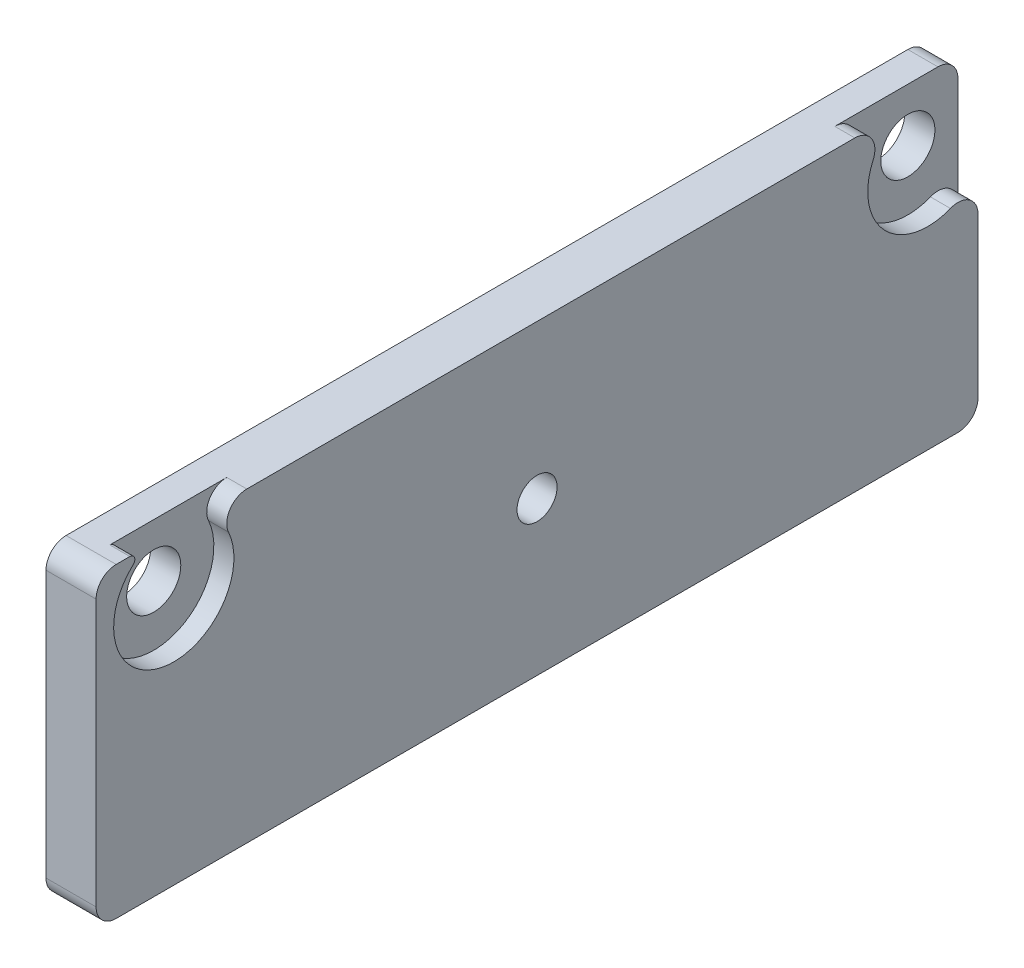
ISO-10303-21;
HEADER;
FILE_DESCRIPTION(('STEP AP214'),'2;1');
FILE_NAME('part.step','',(''),(''),'','','');
FILE_SCHEMA(('AUTOMOTIVE_DESIGN { 1 0 10303 214 1 1 1 1 }'));
ENDSEC;
DATA;
#1=APPLICATION_CONTEXT('core data for automotive mechanical design processes');
#2=APPLICATION_PROTOCOL_DEFINITION('international standard','automotive_design',2000,#1);
#3=PRODUCT_CONTEXT('',#1,'mechanical');
#4=PRODUCT('Part','Part','',(#3));
#5=PRODUCT_RELATED_PRODUCT_CATEGORY('part','',(#4));
#6=PRODUCT_DEFINITION_FORMATION('','',#4);
#7=PRODUCT_DEFINITION_CONTEXT('part definition',#1,'design');
#8=PRODUCT_DEFINITION('design','',#6,#7);
#9=PRODUCT_DEFINITION_SHAPE('','',#8);
#10=(LENGTH_UNIT() NAMED_UNIT(*) SI_UNIT(.MILLI.,.METRE.));
#11=(NAMED_UNIT(*) PLANE_ANGLE_UNIT() SI_UNIT($,.RADIAN.));
#12=(NAMED_UNIT(*) SI_UNIT($,.STERADIAN.) SOLID_ANGLE_UNIT());
#13=UNCERTAINTY_MEASURE_WITH_UNIT(LENGTH_MEASURE(1.E-05),#10,'distance_accuracy_value','');
#14=(GEOMETRIC_REPRESENTATION_CONTEXT(3) GLOBAL_UNCERTAINTY_ASSIGNED_CONTEXT((#13)) GLOBAL_UNIT_ASSIGNED_CONTEXT((#10,
#11,#12)) REPRESENTATION_CONTEXT('',''));
#15=CARTESIAN_POINT('',(0.,0.,0.));
#16=DIRECTION('',(0.,0.,1.));
#17=DIRECTION('',(1.,0.,0.));
#18=AXIS2_PLACEMENT_3D('',#15,#16,#17);
#19=CARTESIAN_POINT('',(2.5,0.,0.));
#20=DIRECTION('',(-1.,0.,0.));
#21=DIRECTION('',(0.,0.,1.));
#22=AXIS2_PLACEMENT_3D('',#19,#20,#21);
#23=PLANE('',#22);
#24=CARTESIAN_POINT('',(2.5,0.,0.));
#25=DIRECTION('',(1.,0.,0.));
#26=DIRECTION('',(0.,0.,-1.));
#27=AXIS2_PLACEMENT_3D('',#24,#25,#26);
#28=CIRCLE('',#27,1.);
#29=CARTESIAN_POINT('',(2.5,0.,-1.));
#30=VERTEX_POINT('',#29);
#31=EDGE_CURVE('E332',#30,#30,#28,.T.);
#32=ORIENTED_EDGE('',*,*,#31,.F.);
#33=EDGE_LOOP('',(#32));
#34=FACE_BOUND('',#33,.T.);
#35=CARTESIAN_POINT('',(2.5,5.,18.125));
#36=DIRECTION('',(1.,0.,0.));
#37=DIRECTION('',(0.,0.,-1.));
#38=AXIS2_PLACEMENT_3D('',#35,#36,#37);
#39=CIRCLE('',#38,3.);
#40=CARTESIAN_POINT('',(2.5,7.21538461538461,20.1478868000749));
#41=VERTEX_POINT('',#40);
#42=CARTESIAN_POINT('',(2.5,6.2375,15.3921271983497));
#43=VERTEX_POINT('',#42);
#44=EDGE_CURVE('E244',#41,#43,#39,.T.);
#45=ORIENTED_EDGE('',*,*,#44,.F.);
#46=CARTESIAN_POINT('',(2.5,7.4,20.3164607000811));
#47=DIRECTION('',(-1.,0.,0.));
#48=DIRECTION('',(0.,0.,1.));
#49=AXIS2_PLACEMENT_3D('',#46,#47,#48);
#50=CIRCLE('',#49,0.25);
#51=CARTESIAN_POINT('',(2.5,7.65,20.3164607000811));
#52=VERTEX_POINT('',#51);
#53=EDGE_CURVE('E47',#41,#52,#50,.F.);
#54=ORIENTED_EDGE('',*,*,#53,.T.);
#55=DIRECTION('',(0.,0.,1.));
#56=VECTOR('',#55,1.);
#57=CARTESIAN_POINT('',(2.5,7.65,22.));
#58=LINE('',#57,#56);
#59=CARTESIAN_POINT('',(2.5,7.65,21.));
#60=VERTEX_POINT('',#59);
#61=EDGE_CURVE('E243',#52,#60,#58,.T.);
#62=ORIENTED_EDGE('',*,*,#61,.T.);
#63=CARTESIAN_POINT('',(2.5,6.65,21.));
#64=DIRECTION('',(-1.,0.,0.));
#65=DIRECTION('',(0.,0.,1.));
#66=AXIS2_PLACEMENT_3D('',#63,#64,#65);
#67=CIRCLE('',#66,1.);
#68=CARTESIAN_POINT('',(2.5,6.65,22.));
#69=VERTEX_POINT('',#68);
#70=EDGE_CURVE('E198',#60,#69,#67,.F.);
#71=ORIENTED_EDGE('',*,*,#70,.T.);
#72=DIRECTION('',(0.,-1.,0.));
#73=VECTOR('',#72,1.);
#74=CARTESIAN_POINT('',(2.5,-7.65,22.));
#75=LINE('',#74,#73);
#76=CARTESIAN_POINT('',(2.5,-6.65,22.));
#77=VERTEX_POINT('',#76);
#78=EDGE_CURVE('E320',#69,#77,#75,.T.);
#79=ORIENTED_EDGE('',*,*,#78,.T.);
#80=CARTESIAN_POINT('',(2.5,-6.65,21.));
#81=DIRECTION('',(-1.,0.,0.));
#82=DIRECTION('',(0.,0.,1.));
#83=AXIS2_PLACEMENT_3D('',#80,#81,#82);
#84=CIRCLE('',#83,1.);
#85=CARTESIAN_POINT('',(2.5,-7.65,21.));
#86=VERTEX_POINT('',#85);
#87=EDGE_CURVE('E194',#77,#86,#84,.F.);
#88=ORIENTED_EDGE('',*,*,#87,.T.);
#89=DIRECTION('',(0.,0.,-1.));
#90=VECTOR('',#89,1.);
#91=CARTESIAN_POINT('',(2.5,-7.65,22.));
#92=LINE('',#91,#90);
#93=CARTESIAN_POINT('',(2.5,-7.65,-21.));
#94=VERTEX_POINT('',#93);
#95=EDGE_CURVE('E317',#86,#94,#92,.T.);
#96=ORIENTED_EDGE('',*,*,#95,.T.);
#97=CARTESIAN_POINT('',(2.5,-6.65,-21.));
#98=DIRECTION('',(-1.,0.,0.));
#99=DIRECTION('',(0.,0.,1.));
#100=AXIS2_PLACEMENT_3D('',#97,#98,#99);
#101=CIRCLE('',#100,1.);
#102=CARTESIAN_POINT('',(2.5,-6.65,-22.));
#103=VERTEX_POINT('',#102);
#104=EDGE_CURVE('E196',#94,#103,#101,.F.);
#105=ORIENTED_EDGE('',*,*,#104,.T.);
#106=DIRECTION('',(0.,1.,0.));
#107=VECTOR('',#106,1.);
#108=CARTESIAN_POINT('',(2.5,-7.65,-22.));
#109=LINE('',#108,#107);
#110=CARTESIAN_POINT('',(2.5,1.29190075645217,-22.));
#111=VERTEX_POINT('',#110);
#112=EDGE_CURVE('E250',#103,#111,#109,.T.);
#113=ORIENTED_EDGE('',*,*,#112,.T.);
#114=CARTESIAN_POINT('',(2.5,1.29190075645217,-21.));
#115=DIRECTION('',(-1.,0.,0.));
#116=DIRECTION('',(0.,0.,1.));
#117=AXIS2_PLACEMENT_3D('',#114,#115,#116);
#118=CIRCLE('',#117,1.);
#119=CARTESIAN_POINT('',(2.5,2.21892556733913,-20.625));
#120=VERTEX_POINT('',#119);
#121=EDGE_CURVE('E192',#111,#120,#118,.F.);
#122=ORIENTED_EDGE('',*,*,#121,.T.);
#123=CARTESIAN_POINT('',(2.5,5.,-19.5));
#124=DIRECTION('',(1.,0.,0.));
#125=DIRECTION('',(0.,0.,-1.));
#126=AXIS2_PLACEMENT_3D('',#123,#124,#125);
#127=CIRCLE('',#126,3.);
#128=CARTESIAN_POINT('',(2.5,6.2375,-16.7671271983497));
#129=VERTEX_POINT('',#128);
#130=EDGE_CURVE('E356',#129,#120,#127,.T.);
#131=ORIENTED_EDGE('',*,*,#130,.F.);
#132=CARTESIAN_POINT('',(2.5,6.65,-15.8561695977996));
#133=DIRECTION('',(-1.,0.,0.));
#134=DIRECTION('',(0.,0.,1.));
#135=AXIS2_PLACEMENT_3D('',#132,#133,#134);
#136=CIRCLE('',#135,1.);
#137=CARTESIAN_POINT('',(2.5,7.65,-15.8561695977996));
#138=VERTEX_POINT('',#137);
#139=EDGE_CURVE('E203',#129,#138,#136,.F.);
#140=ORIENTED_EDGE('',*,*,#139,.T.);
#141=CARTESIAN_POINT('',(2.5,7.65,14.4811695977996));
#142=VERTEX_POINT('',#141);
#143=EDGE_CURVE('E249',#138,#142,#58,.T.);
#144=ORIENTED_EDGE('',*,*,#143,.T.);
#145=CARTESIAN_POINT('',(2.5,6.65,14.4811695977996));
#146=DIRECTION('',(-1.,0.,0.));
#147=DIRECTION('',(0.,0.,1.));
#148=AXIS2_PLACEMENT_3D('',#145,#146,#147);
#149=CIRCLE('',#148,1.);
#150=EDGE_CURVE('E200',#142,#43,#149,.F.);
#151=ORIENTED_EDGE('',*,*,#150,.T.);
#152=EDGE_LOOP('',(#45,#54,#62,#71,#79,#88,#96,#105,#113,#122,#131,#140,#144,#151));
#153=FACE_BOUND('',#152,.T.);
#154=ADVANCED_FACE('F39',(#34,#153),#23,.F.);
#155=CARTESIAN_POINT('',(0.,0.,0.));
#156=DIRECTION('',(-1.,0.,0.));
#157=DIRECTION('',(0.,0.,1.));
#158=AXIS2_PLACEMENT_3D('',#155,#156,#157);
#159=PLANE('',#158);
#160=CARTESIAN_POINT('',(0.,0.,0.));
#161=DIRECTION('',(1.,0.,0.));
#162=DIRECTION('',(0.,0.,-1.));
#163=AXIS2_PLACEMENT_3D('',#160,#161,#162);
#164=CIRCLE('',#163,1.);
#165=CARTESIAN_POINT('',(0.,0.,-1.));
#166=VERTEX_POINT('',#165);
#167=EDGE_CURVE('E342',#166,#166,#164,.T.);
#168=ORIENTED_EDGE('',*,*,#167,.T.);
#169=EDGE_LOOP('',(#168));
#170=FACE_BOUND('',#169,.T.);
#171=DIRECTION('',(0.,-1.,0.));
#172=VECTOR('',#171,1.);
#173=CARTESIAN_POINT('',(0.,-7.65,22.));
#174=LINE('',#173,#172);
#175=CARTESIAN_POINT('',(0.,6.65,22.));
#176=VERTEX_POINT('',#175);
#177=CARTESIAN_POINT('',(0.,-6.65,22.));
#178=VERTEX_POINT('',#177);
#179=EDGE_CURVE('E334',#176,#178,#174,.T.);
#180=ORIENTED_EDGE('',*,*,#179,.F.);
#181=CARTESIAN_POINT('',(0.,6.65,21.));
#182=DIRECTION('',(-1.,0.,0.));
#183=DIRECTION('',(0.,0.,1.));
#184=AXIS2_PLACEMENT_3D('',#181,#182,#183);
#185=CIRCLE('',#184,1.);
#186=CARTESIAN_POINT('',(0.,7.65,21.));
#187=VERTEX_POINT('',#186);
#188=EDGE_CURVE('E218',#176,#187,#185,.T.);
#189=ORIENTED_EDGE('',*,*,#188,.T.);
#190=DIRECTION('',(0.,0.,1.));
#191=VECTOR('',#190,1.);
#192=CARTESIAN_POINT('',(0.,7.65,22.));
#193=LINE('',#192,#191);
#194=CARTESIAN_POINT('',(0.,7.65,-21.));
#195=VERTEX_POINT('',#194);
#196=EDGE_CURVE('E331',#195,#187,#193,.T.);
#197=ORIENTED_EDGE('',*,*,#196,.F.);
#198=CARTESIAN_POINT('',(0.,6.65,-21.));
#199=DIRECTION('',(-1.,0.,0.));
#200=DIRECTION('',(0.,0.,1.));
#201=AXIS2_PLACEMENT_3D('',#198,#199,#200);
#202=CIRCLE('',#201,1.);
#203=CARTESIAN_POINT('',(0.,6.65,-22.));
#204=VERTEX_POINT('',#203);
#205=EDGE_CURVE('E177',#195,#204,#202,.T.);
#206=ORIENTED_EDGE('',*,*,#205,.T.);
#207=DIRECTION('',(0.,1.,0.));
#208=VECTOR('',#207,1.);
#209=CARTESIAN_POINT('',(0.,-7.65,-22.));
#210=LINE('',#209,#208);
#211=CARTESIAN_POINT('',(0.,-6.65,-22.));
#212=VERTEX_POINT('',#211);
#213=EDGE_CURVE('E328',#212,#204,#210,.T.);
#214=ORIENTED_EDGE('',*,*,#213,.F.);
#215=CARTESIAN_POINT('',(0.,-6.65,-21.));
#216=DIRECTION('',(-1.,0.,0.));
#217=DIRECTION('',(0.,0.,1.));
#218=AXIS2_PLACEMENT_3D('',#215,#216,#217);
#219=CIRCLE('',#218,1.);
#220=CARTESIAN_POINT('',(0.,-7.65,-21.));
#221=VERTEX_POINT('',#220);
#222=EDGE_CURVE('E215',#212,#221,#219,.T.);
#223=ORIENTED_EDGE('',*,*,#222,.T.);
#224=DIRECTION('',(0.,0.,-1.));
#225=VECTOR('',#224,1.);
#226=CARTESIAN_POINT('',(0.,-7.65,22.));
#227=LINE('',#226,#225);
#228=CARTESIAN_POINT('',(0.,-7.65,21.));
#229=VERTEX_POINT('',#228);
#230=EDGE_CURVE('E337',#229,#221,#227,.T.);
#231=ORIENTED_EDGE('',*,*,#230,.F.);
#232=CARTESIAN_POINT('',(0.,-6.65,21.));
#233=DIRECTION('',(-1.,0.,0.));
#234=DIRECTION('',(0.,0.,1.));
#235=AXIS2_PLACEMENT_3D('',#232,#233,#234);
#236=CIRCLE('',#235,1.);
#237=EDGE_CURVE('E213',#229,#178,#236,.T.);
#238=ORIENTED_EDGE('',*,*,#237,.T.);
#239=EDGE_LOOP('',(#180,#189,#197,#206,#214,#223,#231,#238));
#240=FACE_BOUND('',#239,.T.);
#241=CARTESIAN_POINT('',(0.,5.,-19.5));
#242=DIRECTION('',(1.,0.,0.));
#243=DIRECTION('',(0.,0.,-1.));
#244=AXIS2_PLACEMENT_3D('',#241,#242,#243);
#245=CIRCLE('',#244,1.35);
#246=CARTESIAN_POINT('',(0.,5.,-20.85));
#247=VERTEX_POINT('',#246);
#248=EDGE_CURVE('E345',#247,#247,#245,.T.);
#249=ORIENTED_EDGE('',*,*,#248,.T.);
#250=EDGE_LOOP('',(#249));
#251=FACE_BOUND('',#250,.T.);
#252=CARTESIAN_POINT('',(0.,5.,18.125));
#253=DIRECTION('',(1.,0.,0.));
#254=DIRECTION('',(0.,0.,-1.));
#255=AXIS2_PLACEMENT_3D('',#252,#253,#254);
#256=CIRCLE('',#255,1.35);
#257=CARTESIAN_POINT('',(0.,5.,16.775));
#258=VERTEX_POINT('',#257);
#259=EDGE_CURVE('E359',#258,#258,#256,.T.);
#260=ORIENTED_EDGE('',*,*,#259,.T.);
#261=EDGE_LOOP('',(#260));
#262=FACE_BOUND('',#261,.T.);
#263=ADVANCED_FACE('F261',(#170,#240,#251,#262),#159,.T.);
#264=CARTESIAN_POINT('',(2.5,-7.65,-22.));
#265=DIRECTION('',(0.,0.,1.));
#266=DIRECTION('',(1.,0.,0.));
#267=AXIS2_PLACEMENT_3D('',#264,#265,#266);
#268=PLANE('',#267);
#269=ORIENTED_EDGE('',*,*,#213,.T.);
#270=DIRECTION('',(-1.,0.,0.));
#271=VECTOR('',#270,1.);
#272=CARTESIAN_POINT('',(2.5,6.65,-22.));
#273=LINE('',#272,#271);
#274=CARTESIAN_POINT('',(1.5,6.65,-22.));
#275=VERTEX_POINT('',#274);
#276=EDGE_CURVE('E161',#204,#275,#273,.F.);
#277=ORIENTED_EDGE('',*,*,#276,.T.);
#278=DIRECTION('',(0.,-1.,0.));
#279=VECTOR('',#278,1.);
#280=CARTESIAN_POINT('',(1.5,-7.65,-22.));
#281=LINE('',#280,#279);
#282=CARTESIAN_POINT('',(1.5,1.29190075645217,-22.));
#283=VERTEX_POINT('',#282);
#284=EDGE_CURVE('E156',#275,#283,#281,.T.);
#285=ORIENTED_EDGE('',*,*,#284,.T.);
#286=DIRECTION('',(1.,0.,0.));
#287=VECTOR('',#286,1.);
#288=CARTESIAN_POINT('',(2.5,1.29190075645217,-22.));
#289=LINE('',#288,#287);
#290=EDGE_CURVE('E220',#283,#111,#289,.T.);
#291=ORIENTED_EDGE('',*,*,#290,.T.);
#292=ORIENTED_EDGE('',*,*,#112,.F.);
#293=DIRECTION('',(-1.,0.,0.));
#294=VECTOR('',#293,1.);
#295=CARTESIAN_POINT('',(2.5,-6.65,-22.));
#296=LINE('',#295,#294);
#297=EDGE_CURVE('E223',#103,#212,#296,.T.);
#298=ORIENTED_EDGE('',*,*,#297,.T.);
#299=EDGE_LOOP('',(#269,#277,#285,#291,#292,#298));
#300=FACE_BOUND('',#299,.T.);
#301=ADVANCED_FACE('F268',(#300),#268,.F.);
#302=CARTESIAN_POINT('',(2.5,7.65,22.));
#303=DIRECTION('',(0.,-1.,0.));
#304=DIRECTION('',(0.,0.,-1.));
#305=AXIS2_PLACEMENT_3D('',#302,#303,#304);
#306=PLANE('',#305);
#307=ORIENTED_EDGE('',*,*,#61,.F.);
#308=DIRECTION('',(1.,0.,0.));
#309=VECTOR('',#308,1.);
#310=CARTESIAN_POINT('',(2.5,7.65,20.3164607000811));
#311=LINE('',#310,#309);
#312=CARTESIAN_POINT('',(1.5,7.65,20.3164607000811));
#313=VERTEX_POINT('',#312);
#314=EDGE_CURVE('E238',#52,#313,#311,.F.);
#315=ORIENTED_EDGE('',*,*,#314,.T.);
#316=DIRECTION('',(0.,0.,-1.));
#317=VECTOR('',#316,1.);
#318=CARTESIAN_POINT('',(1.5,7.65,22.));
#319=LINE('',#318,#317);
#320=CARTESIAN_POINT('',(1.5,7.65,14.4811695977996));
#321=VERTEX_POINT('',#320);
#322=EDGE_CURVE('E174',#313,#321,#319,.T.);
#323=ORIENTED_EDGE('',*,*,#322,.T.);
#324=DIRECTION('',(1.,0.,0.));
#325=VECTOR('',#324,1.);
#326=CARTESIAN_POINT('',(2.5,7.65,14.4811695977996));
#327=LINE('',#326,#325);
#328=EDGE_CURVE('E181',#321,#142,#327,.T.);
#329=ORIENTED_EDGE('',*,*,#328,.T.);
#330=ORIENTED_EDGE('',*,*,#143,.F.);
#331=DIRECTION('',(1.,0.,0.));
#332=VECTOR('',#331,1.);
#333=CARTESIAN_POINT('',(2.5,7.65,-15.8561695977996));
#334=LINE('',#333,#332);
#335=CARTESIAN_POINT('',(1.5,7.65,-15.8561695977996));
#336=VERTEX_POINT('',#335);
#337=EDGE_CURVE('E173',#138,#336,#334,.F.);
#338=ORIENTED_EDGE('',*,*,#337,.T.);
#339=DIRECTION('',(0.,0.,-1.));
#340=VECTOR('',#339,1.);
#341=CARTESIAN_POINT('',(1.5,7.65,22.));
#342=LINE('',#341,#340);
#343=CARTESIAN_POINT('',(1.5,7.65,-21.));
#344=VERTEX_POINT('',#343);
#345=EDGE_CURVE('E153',#336,#344,#342,.T.);
#346=ORIENTED_EDGE('',*,*,#345,.T.);
#347=DIRECTION('',(-1.,0.,0.));
#348=VECTOR('',#347,1.);
#349=CARTESIAN_POINT('',(2.5,7.65,-21.));
#350=LINE('',#349,#348);
#351=EDGE_CURVE('E169',#344,#195,#350,.T.);
#352=ORIENTED_EDGE('',*,*,#351,.T.);
#353=ORIENTED_EDGE('',*,*,#196,.T.);
#354=DIRECTION('',(-1.,0.,0.));
#355=VECTOR('',#354,1.);
#356=CARTESIAN_POINT('',(2.5,7.65,21.));
#357=LINE('',#356,#355);
#358=EDGE_CURVE('E178',#187,#60,#357,.F.);
#359=ORIENTED_EDGE('',*,*,#358,.T.);
#360=EDGE_LOOP('',(#307,#315,#323,#329,#330,#338,#346,#352,#353,#359));
#361=FACE_BOUND('',#360,.T.);
#362=ADVANCED_FACE('F167',(#361),#306,.F.);
#363=CARTESIAN_POINT('',(2.5,-7.65,22.));
#364=DIRECTION('',(0.,0.,-1.));
#365=DIRECTION('',(-1.,0.,0.));
#366=AXIS2_PLACEMENT_3D('',#363,#364,#365);
#367=PLANE('',#366);
#368=ORIENTED_EDGE('',*,*,#78,.F.);
#369=DIRECTION('',(-1.,0.,0.));
#370=VECTOR('',#369,1.);
#371=CARTESIAN_POINT('',(2.5,6.65,22.));
#372=LINE('',#371,#370);
#373=EDGE_CURVE('E210',#69,#176,#372,.T.);
#374=ORIENTED_EDGE('',*,*,#373,.T.);
#375=ORIENTED_EDGE('',*,*,#179,.T.);
#376=DIRECTION('',(-1.,0.,0.));
#377=VECTOR('',#376,1.);
#378=CARTESIAN_POINT('',(2.5,-6.65,22.));
#379=LINE('',#378,#377);
#380=EDGE_CURVE('E208',#178,#77,#379,.F.);
#381=ORIENTED_EDGE('',*,*,#380,.T.);
#382=EDGE_LOOP('',(#368,#374,#375,#381));
#383=FACE_BOUND('',#382,.T.);
#384=ADVANCED_FACE('F279',(#383),#367,.F.);
#385=CARTESIAN_POINT('',(2.5,-7.65,22.));
#386=DIRECTION('',(0.,1.,0.));
#387=DIRECTION('',(0.,0.,1.));
#388=AXIS2_PLACEMENT_3D('',#385,#386,#387);
#389=PLANE('',#388);
#390=ORIENTED_EDGE('',*,*,#230,.T.);
#391=DIRECTION('',(-1.,0.,0.));
#392=VECTOR('',#391,1.);
#393=CARTESIAN_POINT('',(2.5,-7.65,-21.));
#394=LINE('',#393,#392);
#395=EDGE_CURVE('E229',#221,#94,#394,.F.);
#396=ORIENTED_EDGE('',*,*,#395,.T.);
#397=ORIENTED_EDGE('',*,*,#95,.F.);
#398=DIRECTION('',(-1.,0.,0.));
#399=VECTOR('',#398,1.);
#400=CARTESIAN_POINT('',(2.5,-7.65,21.));
#401=LINE('',#400,#399);
#402=EDGE_CURVE('E160',#86,#229,#401,.T.);
#403=ORIENTED_EDGE('',*,*,#402,.T.);
#404=EDGE_LOOP('',(#390,#396,#397,#403));
#405=FACE_BOUND('',#404,.T.);
#406=ADVANCED_FACE('F276',(#405),#389,.F.);
#407=CARTESIAN_POINT('',(2.5,0.,0.));
#408=DIRECTION('',(-1.,0.,0.));
#409=DIRECTION('',(0.,0.,1.));
#410=AXIS2_PLACEMENT_3D('',#407,#408,#409);
#411=CYLINDRICAL_SURFACE('',#410,1.);
#412=ORIENTED_EDGE('',*,*,#31,.T.);
#413=EDGE_LOOP('',(#412));
#414=FACE_BOUND('',#413,.T.);
#415=ORIENTED_EDGE('',*,*,#167,.F.);
#416=EDGE_LOOP('',(#415));
#417=FACE_BOUND('',#416,.T.);
#418=ADVANCED_FACE('F273',(#414,#417),#411,.F.);
#419=CARTESIAN_POINT('',(1.5,6.35,-19.5));
#420=DIRECTION('',(-1.,0.,0.));
#421=DIRECTION('',(0.,0.,1.));
#422=AXIS2_PLACEMENT_3D('',#419,#420,#421);
#423=PLANE('',#422);
#424=CARTESIAN_POINT('',(1.5,5.,-19.5));
#425=DIRECTION('',(1.,0.,0.));
#426=DIRECTION('',(0.,0.,-1.));
#427=AXIS2_PLACEMENT_3D('',#424,#425,#426);
#428=CIRCLE('',#427,1.35);
#429=CARTESIAN_POINT('',(1.5,5.,-20.85));
#430=VERTEX_POINT('',#429);
#431=EDGE_CURVE('E350',#430,#430,#428,.T.);
#432=ORIENTED_EDGE('',*,*,#431,.F.);
#433=EDGE_LOOP('',(#432));
#434=FACE_BOUND('',#433,.T.);
#435=ORIENTED_EDGE('',*,*,#284,.F.);
#436=CARTESIAN_POINT('',(1.5,6.65,-21.));
#437=DIRECTION('',(-1.,0.,0.));
#438=DIRECTION('',(0.,0.,1.));
#439=AXIS2_PLACEMENT_3D('',#436,#437,#438);
#440=CIRCLE('',#439,1.);
#441=EDGE_CURVE('E150',#275,#344,#440,.F.);
#442=ORIENTED_EDGE('',*,*,#441,.T.);
#443=ORIENTED_EDGE('',*,*,#345,.F.);
#444=CARTESIAN_POINT('',(1.5,6.65,-15.8561695977996));
#445=DIRECTION('',(-1.,0.,0.));
#446=DIRECTION('',(0.,0.,1.));
#447=AXIS2_PLACEMENT_3D('',#444,#445,#446);
#448=CIRCLE('',#447,1.);
#449=CARTESIAN_POINT('',(1.5,6.2375,-16.7671271983497));
#450=VERTEX_POINT('',#449);
#451=EDGE_CURVE('E231',#336,#450,#448,.T.);
#452=ORIENTED_EDGE('',*,*,#451,.T.);
#453=CARTESIAN_POINT('',(1.5,5.,-19.5));
#454=DIRECTION('',(1.,0.,0.));
#455=DIRECTION('',(0.,0.,-1.));
#456=AXIS2_PLACEMENT_3D('',#453,#454,#455);
#457=CIRCLE('',#456,3.);
#458=CARTESIAN_POINT('',(1.5,2.21892556733913,-20.625));
#459=VERTEX_POINT('',#458);
#460=EDGE_CURVE('E353',#450,#459,#457,.T.);
#461=ORIENTED_EDGE('',*,*,#460,.T.);
#462=CARTESIAN_POINT('',(1.5,1.29190075645217,-21.));
#463=DIRECTION('',(-1.,0.,0.));
#464=DIRECTION('',(0.,0.,1.));
#465=AXIS2_PLACEMENT_3D('',#462,#463,#464);
#466=CIRCLE('',#465,1.);
#467=EDGE_CURVE('E236',#459,#283,#466,.T.);
#468=ORIENTED_EDGE('',*,*,#467,.T.);
#469=EDGE_LOOP('',(#435,#442,#443,#452,#461,#468));
#470=FACE_BOUND('',#469,.T.);
#471=ADVANCED_FACE('F152',(#434,#470),#423,.F.);
#472=CARTESIAN_POINT('',(2.5,5.,-19.5));
#473=DIRECTION('',(1.,0.,0.));
#474=DIRECTION('',(0.,0.,-1.));
#475=AXIS2_PLACEMENT_3D('',#472,#473,#474);
#476=CYLINDRICAL_SURFACE('',#475,3.);
#477=ORIENTED_EDGE('',*,*,#460,.F.);
#478=DIRECTION('',(1.,0.,0.));
#479=VECTOR('',#478,1.);
#480=CARTESIAN_POINT('',(2.5,6.2375,-16.7671271983497));
#481=LINE('',#480,#479);
#482=EDGE_CURVE('E190',#450,#129,#481,.T.);
#483=ORIENTED_EDGE('',*,*,#482,.T.);
#484=ORIENTED_EDGE('',*,*,#130,.T.);
#485=DIRECTION('',(1.,0.,0.));
#486=VECTOR('',#485,1.);
#487=CARTESIAN_POINT('',(2.5,2.21892556733913,-20.625));
#488=LINE('',#487,#486);
#489=EDGE_CURVE('E188',#120,#459,#488,.F.);
#490=ORIENTED_EDGE('',*,*,#489,.T.);
#491=EDGE_LOOP('',(#477,#483,#484,#490));
#492=FACE_BOUND('',#491,.T.);
#493=ADVANCED_FACE('F378',(#492),#476,.F.);
#494=CARTESIAN_POINT('',(2.5,5.,-19.5));
#495=DIRECTION('',(1.,0.,0.));
#496=DIRECTION('',(0.,0.,-1.));
#497=AXIS2_PLACEMENT_3D('',#494,#495,#496);
#498=CYLINDRICAL_SURFACE('',#497,1.35);
#499=ORIENTED_EDGE('',*,*,#248,.F.);
#500=EDGE_LOOP('',(#499));
#501=FACE_BOUND('',#500,.T.);
#502=ORIENTED_EDGE('',*,*,#431,.T.);
#503=EDGE_LOOP('',(#502));
#504=FACE_BOUND('',#503,.T.);
#505=ADVANCED_FACE('F398',(#501,#504),#498,.F.);
#506=CARTESIAN_POINT('',(1.5,6.35,18.125));
#507=DIRECTION('',(-1.,0.,0.));
#508=DIRECTION('',(0.,0.,1.));
#509=AXIS2_PLACEMENT_3D('',#506,#507,#508);
#510=PLANE('',#509);
#511=CARTESIAN_POINT('',(1.5,5.,18.125));
#512=DIRECTION('',(1.,0.,0.));
#513=DIRECTION('',(0.,0.,-1.));
#514=AXIS2_PLACEMENT_3D('',#511,#512,#513);
#515=CIRCLE('',#514,1.35);
#516=CARTESIAN_POINT('',(1.5,5.,16.775));
#517=VERTEX_POINT('',#516);
#518=EDGE_CURVE('E362',#517,#517,#515,.T.);
#519=ORIENTED_EDGE('',*,*,#518,.F.);
#520=EDGE_LOOP('',(#519));
#521=FACE_BOUND('',#520,.T.);
#522=ORIENTED_EDGE('',*,*,#322,.F.);
#523=CARTESIAN_POINT('',(1.5,7.4,20.3164607000811));
#524=DIRECTION('',(-1.,0.,0.));
#525=DIRECTION('',(0.,0.,1.));
#526=AXIS2_PLACEMENT_3D('',#523,#524,#525);
#527=CIRCLE('',#526,0.25);
#528=CARTESIAN_POINT('',(1.5,7.21538461538461,20.1478868000749));
#529=VERTEX_POINT('',#528);
#530=EDGE_CURVE('E11',#313,#529,#527,.T.);
#531=ORIENTED_EDGE('',*,*,#530,.T.);
#532=CARTESIAN_POINT('',(1.5,5.,18.125));
#533=DIRECTION('',(1.,0.,0.));
#534=DIRECTION('',(0.,0.,-1.));
#535=AXIS2_PLACEMENT_3D('',#532,#533,#534);
#536=CIRCLE('',#535,3.);
#537=CARTESIAN_POINT('',(1.5,6.2375,15.3921271983497));
#538=VERTEX_POINT('',#537);
#539=EDGE_CURVE('E365',#529,#538,#536,.T.);
#540=ORIENTED_EDGE('',*,*,#539,.T.);
#541=CARTESIAN_POINT('',(1.5,6.65,14.4811695977996));
#542=DIRECTION('',(-1.,0.,0.));
#543=DIRECTION('',(0.,0.,1.));
#544=AXIS2_PLACEMENT_3D('',#541,#542,#543);
#545=CIRCLE('',#544,1.);
#546=EDGE_CURVE('E233',#538,#321,#545,.T.);
#547=ORIENTED_EDGE('',*,*,#546,.T.);
#548=EDGE_LOOP('',(#522,#531,#540,#547));
#549=FACE_BOUND('',#548,.T.);
#550=ADVANCED_FACE('F372',(#521,#549),#510,.F.);
#551=CARTESIAN_POINT('',(2.5,5.,18.125));
#552=DIRECTION('',(1.,0.,0.));
#553=DIRECTION('',(0.,0.,-1.));
#554=AXIS2_PLACEMENT_3D('',#551,#552,#553);
#555=CYLINDRICAL_SURFACE('',#554,3.);
#556=ORIENTED_EDGE('',*,*,#539,.F.);
#557=DIRECTION('',(1.,0.,0.));
#558=VECTOR('',#557,1.);
#559=CARTESIAN_POINT('',(2.5,7.21538461538461,20.1478868000749));
#560=LINE('',#559,#558);
#561=EDGE_CURVE('E59',#529,#41,#560,.T.);
#562=ORIENTED_EDGE('',*,*,#561,.T.);
#563=ORIENTED_EDGE('',*,*,#44,.T.);
#564=DIRECTION('',(1.,0.,0.));
#565=VECTOR('',#564,1.);
#566=CARTESIAN_POINT('',(2.5,6.2375,15.3921271983497));
#567=LINE('',#566,#565);
#568=EDGE_CURVE('E205',#43,#538,#567,.F.);
#569=ORIENTED_EDGE('',*,*,#568,.T.);
#570=EDGE_LOOP('',(#556,#562,#563,#569));
#571=FACE_BOUND('',#570,.T.);
#572=ADVANCED_FACE('F367',(#571),#555,.F.);
#573=CARTESIAN_POINT('',(2.5,5.,18.125));
#574=DIRECTION('',(1.,0.,0.));
#575=DIRECTION('',(0.,0.,-1.));
#576=AXIS2_PLACEMENT_3D('',#573,#574,#575);
#577=CYLINDRICAL_SURFACE('',#576,1.35);
#578=ORIENTED_EDGE('',*,*,#259,.F.);
#579=EDGE_LOOP('',(#578));
#580=FACE_BOUND('',#579,.T.);
#581=ORIENTED_EDGE('',*,*,#518,.T.);
#582=EDGE_LOOP('',(#581));
#583=FACE_BOUND('',#582,.T.);
#584=ADVANCED_FACE('F292',(#580,#583),#577,.F.);
#585=CARTESIAN_POINT('',(2.5,6.65,-15.8561695977996));
#586=DIRECTION('',(1.,0.,0.));
#587=DIRECTION('',(0.,0.,-1.));
#588=AXIS2_PLACEMENT_3D('',#585,#586,#587);
#589=CYLINDRICAL_SURFACE('',#588,1.);
#590=ORIENTED_EDGE('',*,*,#139,.F.);
#591=ORIENTED_EDGE('',*,*,#482,.F.);
#592=ORIENTED_EDGE('',*,*,#451,.F.);
#593=ORIENTED_EDGE('',*,*,#337,.F.);
#594=EDGE_LOOP('',(#590,#591,#592,#593));
#595=FACE_BOUND('',#594,.T.);
#596=ADVANCED_FACE('F288',(#595),#589,.T.);
#597=CARTESIAN_POINT('',(2.5,6.65,14.4811695977996));
#598=DIRECTION('',(1.,0.,0.));
#599=DIRECTION('',(0.,0.,-1.));
#600=AXIS2_PLACEMENT_3D('',#597,#598,#599);
#601=CYLINDRICAL_SURFACE('',#600,1.);
#602=ORIENTED_EDGE('',*,*,#546,.F.);
#603=ORIENTED_EDGE('',*,*,#568,.F.);
#604=ORIENTED_EDGE('',*,*,#150,.F.);
#605=ORIENTED_EDGE('',*,*,#328,.F.);
#606=EDGE_LOOP('',(#602,#603,#604,#605));
#607=FACE_BOUND('',#606,.T.);
#608=ADVANCED_FACE('F291',(#607),#601,.T.);
#609=CARTESIAN_POINT('',(2.5,6.65,21.));
#610=DIRECTION('',(-1.,0.,0.));
#611=DIRECTION('',(0.,0.,1.));
#612=AXIS2_PLACEMENT_3D('',#609,#610,#611);
#613=CYLINDRICAL_SURFACE('',#612,1.);
#614=ORIENTED_EDGE('',*,*,#70,.F.);
#615=ORIENTED_EDGE('',*,*,#358,.F.);
#616=ORIENTED_EDGE('',*,*,#188,.F.);
#617=ORIENTED_EDGE('',*,*,#373,.F.);
#618=EDGE_LOOP('',(#614,#615,#616,#617));
#619=FACE_BOUND('',#618,.T.);
#620=ADVANCED_FACE('F296',(#619),#613,.T.);
#621=CARTESIAN_POINT('',(2.5,6.65,-21.));
#622=DIRECTION('',(-1.,0.,0.));
#623=DIRECTION('',(0.,0.,1.));
#624=AXIS2_PLACEMENT_3D('',#621,#622,#623);
#625=CYLINDRICAL_SURFACE('',#624,1.);
#626=ORIENTED_EDGE('',*,*,#441,.F.);
#627=ORIENTED_EDGE('',*,*,#276,.F.);
#628=ORIENTED_EDGE('',*,*,#205,.F.);
#629=ORIENTED_EDGE('',*,*,#351,.F.);
#630=EDGE_LOOP('',(#626,#627,#628,#629));
#631=FACE_BOUND('',#630,.T.);
#632=ADVANCED_FACE('F176',(#631),#625,.T.);
#633=CARTESIAN_POINT('',(2.5,-6.65,-21.));
#634=DIRECTION('',(-1.,0.,0.));
#635=DIRECTION('',(0.,0.,1.));
#636=AXIS2_PLACEMENT_3D('',#633,#634,#635);
#637=CYLINDRICAL_SURFACE('',#636,1.);
#638=ORIENTED_EDGE('',*,*,#104,.F.);
#639=ORIENTED_EDGE('',*,*,#395,.F.);
#640=ORIENTED_EDGE('',*,*,#222,.F.);
#641=ORIENTED_EDGE('',*,*,#297,.F.);
#642=EDGE_LOOP('',(#638,#639,#640,#641));
#643=FACE_BOUND('',#642,.T.);
#644=ADVANCED_FACE('F303',(#643),#637,.T.);
#645=CARTESIAN_POINT('',(2.5,-6.65,21.));
#646=DIRECTION('',(-1.,0.,0.));
#647=DIRECTION('',(0.,0.,1.));
#648=AXIS2_PLACEMENT_3D('',#645,#646,#647);
#649=CYLINDRICAL_SURFACE('',#648,1.);
#650=ORIENTED_EDGE('',*,*,#87,.F.);
#651=ORIENTED_EDGE('',*,*,#380,.F.);
#652=ORIENTED_EDGE('',*,*,#237,.F.);
#653=ORIENTED_EDGE('',*,*,#402,.F.);
#654=EDGE_LOOP('',(#650,#651,#652,#653));
#655=FACE_BOUND('',#654,.T.);
#656=ADVANCED_FACE('F258',(#655),#649,.T.);
#657=CARTESIAN_POINT('',(2.5,1.29190075645217,-21.));
#658=DIRECTION('',(1.,0.,0.));
#659=DIRECTION('',(0.,0.,-1.));
#660=AXIS2_PLACEMENT_3D('',#657,#658,#659);
#661=CYLINDRICAL_SURFACE('',#660,1.);
#662=ORIENTED_EDGE('',*,*,#467,.F.);
#663=ORIENTED_EDGE('',*,*,#489,.F.);
#664=ORIENTED_EDGE('',*,*,#121,.F.);
#665=ORIENTED_EDGE('',*,*,#290,.F.);
#666=EDGE_LOOP('',(#662,#663,#664,#665));
#667=FACE_BOUND('',#666,.T.);
#668=ADVANCED_FACE('F253',(#667),#661,.T.);
#669=CARTESIAN_POINT('',(2.5,7.4,20.3164607000811));
#670=DIRECTION('',(1.,0.,0.));
#671=DIRECTION('',(0.,0.,-1.));
#672=AXIS2_PLACEMENT_3D('',#669,#670,#671);
#673=CYLINDRICAL_SURFACE('',#672,0.25);
#674=ORIENTED_EDGE('',*,*,#53,.F.);
#675=ORIENTED_EDGE('',*,*,#561,.F.);
#676=ORIENTED_EDGE('',*,*,#530,.F.);
#677=ORIENTED_EDGE('',*,*,#314,.F.);
#678=EDGE_LOOP('',(#674,#675,#676,#677));
#679=FACE_BOUND('',#678,.T.);
#680=ADVANCED_FACE('F41',(#679),#673,.T.);
#681=CLOSED_SHELL('',(#154,#263,#301,#362,#384,#406,#418,#471,#493,#505,#550,#572,#584,#596,
#608,#620,#632,#644,#656,#668,#680));
#682=MANIFOLD_SOLID_BREP('B2',#681);
#683=ADVANCED_BREP_SHAPE_REPRESENTATION('',(#18,#682),#14);
#684=SHAPE_DEFINITION_REPRESENTATION(#9,#683);
ENDSEC;
END-ISO-10303-21;
